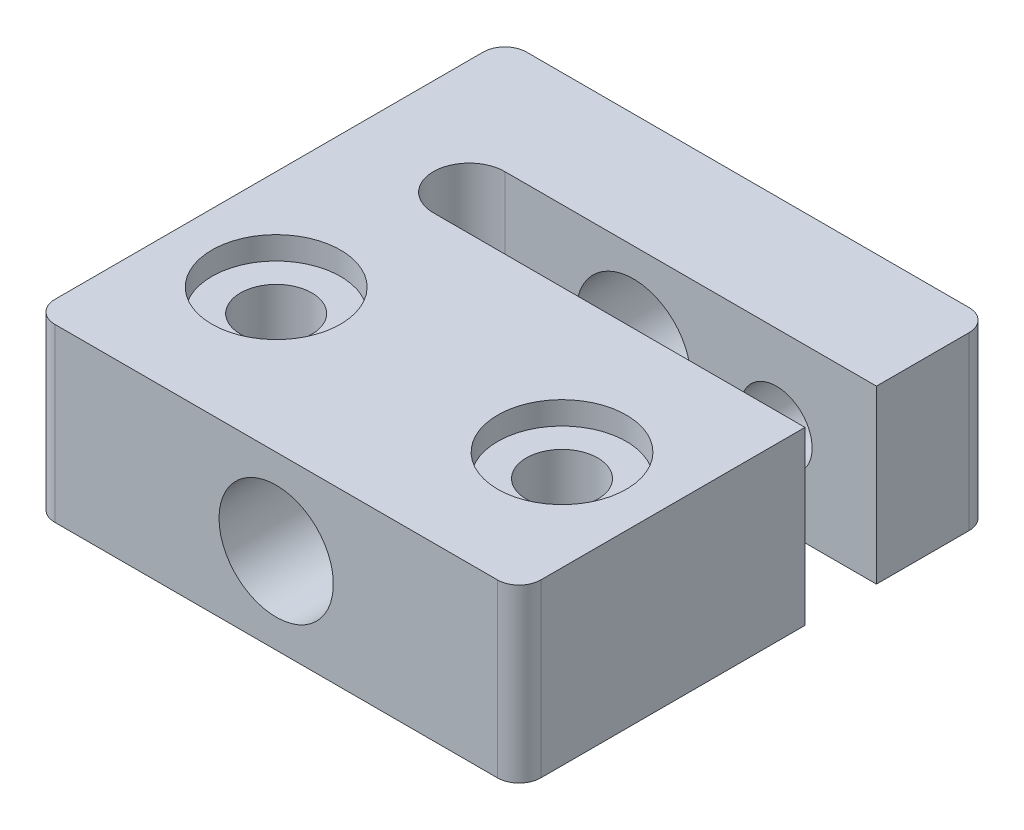
ISO-10303-21;
HEADER;
FILE_DESCRIPTION(('STEP AP214'),'2;1');
FILE_NAME('part.step','',(''),(''),'','','');
FILE_SCHEMA(('AUTOMOTIVE_DESIGN { 1 0 10303 214 1 1 1 1 }'));
ENDSEC;
DATA;
#1=APPLICATION_CONTEXT('core data for automotive mechanical design processes');
#2=APPLICATION_PROTOCOL_DEFINITION('international standard','automotive_design',2000,#1);
#3=PRODUCT_CONTEXT('',#1,'mechanical');
#4=PRODUCT('Part','Part','',(#3));
#5=PRODUCT_RELATED_PRODUCT_CATEGORY('part','',(#4));
#6=PRODUCT_DEFINITION_FORMATION('','',#4);
#7=PRODUCT_DEFINITION_CONTEXT('part definition',#1,'design');
#8=PRODUCT_DEFINITION('design','',#6,#7);
#9=PRODUCT_DEFINITION_SHAPE('','',#8);
#10=(LENGTH_UNIT() NAMED_UNIT(*) SI_UNIT(.MILLI.,.METRE.));
#11=(NAMED_UNIT(*) PLANE_ANGLE_UNIT() SI_UNIT($,.RADIAN.));
#12=(NAMED_UNIT(*) SI_UNIT($,.STERADIAN.) SOLID_ANGLE_UNIT());
#13=UNCERTAINTY_MEASURE_WITH_UNIT(LENGTH_MEASURE(1.E-05),#10,'distance_accuracy_value','');
#14=(GEOMETRIC_REPRESENTATION_CONTEXT(3) GLOBAL_UNCERTAINTY_ASSIGNED_CONTEXT((#13)) GLOBAL_UNIT_ASSIGNED_CONTEXT((#10,
#11,#12)) REPRESENTATION_CONTEXT('',''));
#15=CARTESIAN_POINT('',(0.,0.,0.));
#16=DIRECTION('',(0.,0.,1.));
#17=DIRECTION('',(1.,0.,0.));
#18=AXIS2_PLACEMENT_3D('',#15,#16,#17);
#19=CARTESIAN_POINT('',(-10.,12.,-10.));
#20=DIRECTION('',(0.,-1.,0.));
#21=DIRECTION('',(0.,0.,-1.));
#22=AXIS2_PLACEMENT_3D('',#19,#20,#21);
#23=CYLINDRICAL_SURFACE('',#22,2.5);
#24=CARTESIAN_POINT('',(-10.,10.4,-10.));
#25=DIRECTION('',(0.,1.,0.));
#26=DIRECTION('',(0.,0.,1.));
#27=AXIS2_PLACEMENT_3D('',#24,#25,#26);
#28=CIRCLE('',#27,2.5);
#29=CARTESIAN_POINT('',(-10.,10.4,-7.5));
#30=VERTEX_POINT('',#29);
#31=EDGE_CURVE('E310',#30,#30,#28,.T.);
#32=ORIENTED_EDGE('',*,*,#31,.T.);
#33=EDGE_LOOP('',(#32));
#34=FACE_BOUND('',#33,.T.);
#35=CARTESIAN_POINT('',(-10.,4.97,-10.));
#36=DIRECTION('',(0.,-1.,0.));
#37=DIRECTION('',(0.,0.,-1.));
#38=AXIS2_PLACEMENT_3D('',#35,#36,#37);
#39=CIRCLE('',#38,2.5);
#40=CARTESIAN_POINT('',(-10.,4.97,-12.5));
#41=VERTEX_POINT('',#40);
#42=EDGE_CURVE('E37',#41,#41,#39,.T.);
#43=ORIENTED_EDGE('',*,*,#42,.T.);
#44=EDGE_LOOP('',(#43));
#45=FACE_BOUND('',#44,.T.);
#46=ADVANCED_FACE('F33',(#34,#45),#23,.F.);
#47=CARTESIAN_POINT('',(10.,12.,-10.));
#48=DIRECTION('',(0.,-1.,0.));
#49=DIRECTION('',(0.,0.,-1.));
#50=AXIS2_PLACEMENT_3D('',#47,#48,#49);
#51=CYLINDRICAL_SURFACE('',#50,2.5);
#52=CARTESIAN_POINT('',(10.,10.4,-10.));
#53=DIRECTION('',(0.,1.,0.));
#54=DIRECTION('',(0.,0.,1.));
#55=AXIS2_PLACEMENT_3D('',#52,#53,#54);
#56=CIRCLE('',#55,2.5);
#57=CARTESIAN_POINT('',(10.,10.4,-7.50000000000001));
#58=VERTEX_POINT('',#57);
#59=EDGE_CURVE('E303',#58,#58,#56,.T.);
#60=ORIENTED_EDGE('',*,*,#59,.T.);
#61=EDGE_LOOP('',(#60));
#62=FACE_BOUND('',#61,.T.);
#63=CARTESIAN_POINT('',(10.,4.97,-10.));
#64=DIRECTION('',(0.,-1.,0.));
#65=DIRECTION('',(0.,0.,-1.));
#66=AXIS2_PLACEMENT_3D('',#63,#64,#65);
#67=CIRCLE('',#66,2.5);
#68=CARTESIAN_POINT('',(10.,4.97,-12.5));
#69=VERTEX_POINT('',#68);
#70=EDGE_CURVE('E290',#69,#69,#67,.T.);
#71=ORIENTED_EDGE('',*,*,#70,.T.);
#72=EDGE_LOOP('',(#71));
#73=FACE_BOUND('',#72,.T.);
#74=ADVANCED_FACE('F402',(#62,#73),#51,.F.);
#75=CARTESIAN_POINT('',(-15.48,12.,-1.52));
#76=DIRECTION('',(0.,1.,0.));
#77=DIRECTION('',(0.,0.,1.));
#78=AXIS2_PLACEMENT_3D('',#75,#76,#77);
#79=PLANE('',#78);
#80=CARTESIAN_POINT('',(10.,12.,-10.));
#81=DIRECTION('',(0.,1.,0.));
#82=DIRECTION('',(0.,0.,1.));
#83=AXIS2_PLACEMENT_3D('',#80,#81,#82);
#84=CIRCLE('',#83,4.5);
#85=CARTESIAN_POINT('',(10.,12.,-5.5));
#86=VERTEX_POINT('',#85);
#87=EDGE_CURVE('E304',#86,#86,#84,.T.);
#88=ORIENTED_EDGE('',*,*,#87,.F.);
#89=EDGE_LOOP('',(#88));
#90=FACE_BOUND('',#89,.T.);
#91=CARTESIAN_POINT('',(-10.,12.,-10.));
#92=DIRECTION('',(0.,1.,0.));
#93=DIRECTION('',(0.,0.,1.));
#94=AXIS2_PLACEMENT_3D('',#91,#92,#93);
#95=CIRCLE('',#94,4.5);
#96=CARTESIAN_POINT('',(-10.,12.,-5.5));
#97=VERTEX_POINT('',#96);
#98=EDGE_CURVE('E311',#97,#97,#95,.T.);
#99=ORIENTED_EDGE('',*,*,#98,.F.);
#100=EDGE_LOOP('',(#99));
#101=FACE_BOUND('',#100,.T.);
#102=CARTESIAN_POINT('',(-15.48,12.,-1.52));
#103=DIRECTION('',(0.,1.,0.));
#104=DIRECTION('',(0.,0.,1.));
#105=AXIS2_PLACEMENT_3D('',#102,#103,#104);
#106=CIRCLE('',#105,1.52);
#107=CARTESIAN_POINT('',(-17.,12.,-1.52));
#108=VERTEX_POINT('',#107);
#109=CARTESIAN_POINT('',(-15.48,12.,0.));
#110=VERTEX_POINT('',#109);
#111=EDGE_CURVE('E314',#108,#110,#106,.T.);
#112=ORIENTED_EDGE('',*,*,#111,.T.);
#113=DIRECTION('',(1.,0.,0.));
#114=VECTOR('',#113,1.);
#115=CARTESIAN_POINT('',(-15.48,12.,0.));
#116=LINE('',#115,#114);
#117=CARTESIAN_POINT('',(15.48,12.,0.));
#118=VERTEX_POINT('',#117);
#119=EDGE_CURVE('E317',#110,#118,#116,.T.);
#120=ORIENTED_EDGE('',*,*,#119,.T.);
#121=CARTESIAN_POINT('',(15.48,12.,-1.52));
#122=DIRECTION('',(0.,1.,0.));
#123=DIRECTION('',(0.,0.,1.));
#124=AXIS2_PLACEMENT_3D('',#121,#122,#123);
#125=CIRCLE('',#124,1.52);
#126=CARTESIAN_POINT('',(17.,12.,-1.52));
#127=VERTEX_POINT('',#126);
#128=EDGE_CURVE('E320',#118,#127,#125,.T.);
#129=ORIENTED_EDGE('',*,*,#128,.T.);
#130=DIRECTION('',(0.,0.,-1.));
#131=VECTOR('',#130,1.);
#132=CARTESIAN_POINT('',(17.,12.,-1.52));
#133=LINE('',#132,#131);
#134=CARTESIAN_POINT('',(17.,12.,-20.));
#135=VERTEX_POINT('',#134);
#136=EDGE_CURVE('E322',#127,#135,#133,.T.);
#137=ORIENTED_EDGE('',*,*,#136,.T.);
#138=DIRECTION('',(-1.,0.,0.));
#139=VECTOR('',#138,1.);
#140=CARTESIAN_POINT('',(-9.,12.,-20.));
#141=LINE('',#140,#139);
#142=CARTESIAN_POINT('',(-9.,12.,-20.));
#143=VERTEX_POINT('',#142);
#144=EDGE_CURVE('E324',#135,#143,#141,.T.);
#145=ORIENTED_EDGE('',*,*,#144,.T.);
#146=CARTESIAN_POINT('',(-9.,12.,-22.5));
#147=DIRECTION('',(0.,-1.,0.));
#148=DIRECTION('',(0.,0.,1.));
#149=AXIS2_PLACEMENT_3D('',#146,#147,#148);
#150=CIRCLE('',#149,2.5);
#151=CARTESIAN_POINT('',(-9.,12.,-25.));
#152=VERTEX_POINT('',#151);
#153=EDGE_CURVE('E326',#143,#152,#150,.T.);
#154=ORIENTED_EDGE('',*,*,#153,.T.);
#155=DIRECTION('',(1.,0.,0.));
#156=VECTOR('',#155,1.);
#157=CARTESIAN_POINT('',(17.,12.,-25.));
#158=LINE('',#157,#156);
#159=CARTESIAN_POINT('',(17.,12.,-25.));
#160=VERTEX_POINT('',#159);
#161=EDGE_CURVE('E328',#152,#160,#158,.T.);
#162=ORIENTED_EDGE('',*,*,#161,.T.);
#163=DIRECTION('',(0.,0.,-1.));
#164=VECTOR('',#163,1.);
#165=CARTESIAN_POINT('',(17.,12.,-31.48));
#166=LINE('',#165,#164);
#167=CARTESIAN_POINT('',(17.,12.,-31.48));
#168=VERTEX_POINT('',#167);
#169=EDGE_CURVE('E330',#160,#168,#166,.T.);
#170=ORIENTED_EDGE('',*,*,#169,.T.);
#171=CARTESIAN_POINT('',(15.48,12.,-31.48));
#172=DIRECTION('',(0.,1.,0.));
#173=DIRECTION('',(0.,0.,1.));
#174=AXIS2_PLACEMENT_3D('',#171,#172,#173);
#175=CIRCLE('',#174,1.52);
#176=CARTESIAN_POINT('',(15.48,12.,-33.));
#177=VERTEX_POINT('',#176);
#178=EDGE_CURVE('E332',#168,#177,#175,.T.);
#179=ORIENTED_EDGE('',*,*,#178,.T.);
#180=DIRECTION('',(-1.,0.,0.));
#181=VECTOR('',#180,1.);
#182=CARTESIAN_POINT('',(-15.48,12.,-33.));
#183=LINE('',#182,#181);
#184=CARTESIAN_POINT('',(-15.48,12.,-33.));
#185=VERTEX_POINT('',#184);
#186=EDGE_CURVE('E334',#177,#185,#183,.T.);
#187=ORIENTED_EDGE('',*,*,#186,.T.);
#188=CARTESIAN_POINT('',(-15.48,12.,-31.48));
#189=DIRECTION('',(0.,1.,0.));
#190=DIRECTION('',(0.,0.,1.));
#191=AXIS2_PLACEMENT_3D('',#188,#189,#190);
#192=CIRCLE('',#191,1.52);
#193=CARTESIAN_POINT('',(-17.,12.,-31.48));
#194=VERTEX_POINT('',#193);
#195=EDGE_CURVE('E336',#185,#194,#192,.T.);
#196=ORIENTED_EDGE('',*,*,#195,.T.);
#197=DIRECTION('',(0.,0.,1.));
#198=VECTOR('',#197,1.);
#199=CARTESIAN_POINT('',(-17.,12.,-1.52));
#200=LINE('',#199,#198);
#201=EDGE_CURVE('E338',#194,#108,#200,.T.);
#202=ORIENTED_EDGE('',*,*,#201,.T.);
#203=EDGE_LOOP('',(#112,#120,#129,#137,#145,#154,#162,#170,#179,#187,#196,#202));
#204=FACE_BOUND('',#203,.T.);
#205=ADVANCED_FACE('F434',(#90,#101,#204),#79,.T.);
#206=CARTESIAN_POINT('',(-15.48,0.,-1.52));
#207=DIRECTION('',(0.,1.,0.));
#208=DIRECTION('',(0.,0.,1.));
#209=AXIS2_PLACEMENT_3D('',#206,#207,#208);
#210=PLANE('',#209);
#211=DIRECTION('',(0.866025403784439,0.,-0.499999999999999));
#212=VECTOR('',#211,1.);
#213=CARTESIAN_POINT('',(-14.,0.,-12.3094010767585));
#214=LINE('',#213,#212);
#215=CARTESIAN_POINT('',(-14.,0.,-12.3094010767585));
#216=VERTEX_POINT('',#215);
#217=CARTESIAN_POINT('',(-9.99999999999999,0.,-14.618802153517));
#218=VERTEX_POINT('',#217);
#219=EDGE_CURVE('E234',#216,#218,#214,.T.);
#220=ORIENTED_EDGE('',*,*,#219,.F.);
#221=DIRECTION('',(0.,0.,-1.));
#222=VECTOR('',#221,1.);
#223=CARTESIAN_POINT('',(-14.,0.,-7.6905989232415));
#224=LINE('',#223,#222);
#225=CARTESIAN_POINT('',(-14.,0.,-7.6905989232415));
#226=VERTEX_POINT('',#225);
#227=EDGE_CURVE('E50',#226,#216,#224,.T.);
#228=ORIENTED_EDGE('',*,*,#227,.F.);
#229=DIRECTION('',(-0.866025403784439,0.,-0.5));
#230=VECTOR('',#229,1.);
#231=CARTESIAN_POINT('',(-10.,0.,-5.381197846483));
#232=LINE('',#231,#230);
#233=CARTESIAN_POINT('',(-10.,0.,-5.381197846483));
#234=VERTEX_POINT('',#233);
#235=EDGE_CURVE('E217',#234,#226,#232,.T.);
#236=ORIENTED_EDGE('',*,*,#235,.F.);
#237=DIRECTION('',(-0.866025403784439,0.,0.5));
#238=VECTOR('',#237,1.);
#239=CARTESIAN_POINT('',(-6.,0.,-7.6905989232415));
#240=LINE('',#239,#238);
#241=CARTESIAN_POINT('',(-6.,0.,-7.6905989232415));
#242=VERTEX_POINT('',#241);
#243=EDGE_CURVE('E220',#242,#234,#240,.T.);
#244=ORIENTED_EDGE('',*,*,#243,.F.);
#245=DIRECTION('',(0.,0.,1.));
#246=VECTOR('',#245,1.);
#247=CARTESIAN_POINT('',(-6.,0.,-12.3094010767585));
#248=LINE('',#247,#246);
#249=CARTESIAN_POINT('',(-6.,0.,-12.3094010767585));
#250=VERTEX_POINT('',#249);
#251=EDGE_CURVE('E239',#250,#242,#248,.T.);
#252=ORIENTED_EDGE('',*,*,#251,.F.);
#253=DIRECTION('',(0.866025403784439,0.,0.5));
#254=VECTOR('',#253,1.);
#255=CARTESIAN_POINT('',(-9.99999999999999,0.,-14.618802153517));
#256=LINE('',#255,#254);
#257=EDGE_CURVE('E236',#218,#250,#256,.T.);
#258=ORIENTED_EDGE('',*,*,#257,.F.);
#259=EDGE_LOOP('',(#220,#228,#236,#244,#252,#258));
#260=FACE_BOUND('',#259,.T.);
#261=DIRECTION('',(0.,0.,-1.));
#262=VECTOR('',#261,1.);
#263=CARTESIAN_POINT('',(6.00000000000001,0.,-7.6905989232415));
#264=LINE('',#263,#262);
#265=CARTESIAN_POINT('',(6.00000000000001,0.,-7.6905989232415));
#266=VERTEX_POINT('',#265);
#267=CARTESIAN_POINT('',(6.00000000000001,0.,-12.3094010767585));
#268=VERTEX_POINT('',#267);
#269=EDGE_CURVE('E274',#266,#268,#264,.T.);
#270=ORIENTED_EDGE('',*,*,#269,.F.);
#271=DIRECTION('',(-0.866025403784439,0.,-0.5));
#272=VECTOR('',#271,1.);
#273=CARTESIAN_POINT('',(10.,0.,-5.381197846483));
#274=LINE('',#273,#272);
#275=CARTESIAN_POINT('',(10.,0.,-5.381197846483));
#276=VERTEX_POINT('',#275);
#277=EDGE_CURVE('E58',#276,#266,#274,.T.);
#278=ORIENTED_EDGE('',*,*,#277,.F.);
#279=DIRECTION('',(-0.866025403784439,0.,0.5));
#280=VECTOR('',#279,1.);
#281=CARTESIAN_POINT('',(14.,0.,-7.6905989232415));
#282=LINE('',#281,#280);
#283=CARTESIAN_POINT('',(14.,0.,-7.6905989232415));
#284=VERTEX_POINT('',#283);
#285=EDGE_CURVE('E257',#284,#276,#282,.T.);
#286=ORIENTED_EDGE('',*,*,#285,.F.);
#287=DIRECTION('',(0.,0.,1.));
#288=VECTOR('',#287,1.);
#289=CARTESIAN_POINT('',(14.,0.,-12.3094010767585));
#290=LINE('',#289,#288);
#291=CARTESIAN_POINT('',(14.,0.,-12.3094010767585));
#292=VERTEX_POINT('',#291);
#293=EDGE_CURVE('E283',#292,#284,#290,.T.);
#294=ORIENTED_EDGE('',*,*,#293,.F.);
#295=DIRECTION('',(0.866025403784439,0.,0.5));
#296=VECTOR('',#295,1.);
#297=CARTESIAN_POINT('',(10.,0.,-14.618802153517));
#298=LINE('',#297,#296);
#299=CARTESIAN_POINT('',(10.,0.,-14.618802153517));
#300=VERTEX_POINT('',#299);
#301=EDGE_CURVE('E280',#300,#292,#298,.T.);
#302=ORIENTED_EDGE('',*,*,#301,.F.);
#303=DIRECTION('',(0.866025403784439,0.,-0.5));
#304=VECTOR('',#303,1.);
#305=CARTESIAN_POINT('',(6.00000000000001,0.,-12.3094010767585));
#306=LINE('',#305,#304);
#307=EDGE_CURVE('E277',#268,#300,#306,.T.);
#308=ORIENTED_EDGE('',*,*,#307,.F.);
#309=EDGE_LOOP('',(#270,#278,#286,#294,#302,#308));
#310=FACE_BOUND('',#309,.T.);
#311=CARTESIAN_POINT('',(-15.48,0.,-1.52));
#312=DIRECTION('',(0.,1.,0.));
#313=DIRECTION('',(0.,0.,1.));
#314=AXIS2_PLACEMENT_3D('',#311,#312,#313);
#315=CIRCLE('',#314,1.52);
#316=CARTESIAN_POINT('',(-17.,0.,-1.52));
#317=VERTEX_POINT('',#316);
#318=CARTESIAN_POINT('',(-15.48,0.,0.));
#319=VERTEX_POINT('',#318);
#320=EDGE_CURVE('E341',#317,#319,#315,.T.);
#321=ORIENTED_EDGE('',*,*,#320,.F.);
#322=DIRECTION('',(0.,0.,1.));
#323=VECTOR('',#322,1.);
#324=CARTESIAN_POINT('',(-17.,0.,-1.52));
#325=LINE('',#324,#323);
#326=CARTESIAN_POINT('',(-17.,0.,-31.48));
#327=VERTEX_POINT('',#326);
#328=EDGE_CURVE('E318',#327,#317,#325,.T.);
#329=ORIENTED_EDGE('',*,*,#328,.F.);
#330=CARTESIAN_POINT('',(-15.48,0.,-31.48));
#331=DIRECTION('',(0.,1.,0.));
#332=DIRECTION('',(0.,0.,1.));
#333=AXIS2_PLACEMENT_3D('',#330,#331,#332);
#334=CIRCLE('',#333,1.52);
#335=CARTESIAN_POINT('',(-15.48,0.,-33.));
#336=VERTEX_POINT('',#335);
#337=EDGE_CURVE('E362',#336,#327,#334,.T.);
#338=ORIENTED_EDGE('',*,*,#337,.F.);
#339=DIRECTION('',(-1.,0.,0.));
#340=VECTOR('',#339,1.);
#341=CARTESIAN_POINT('',(-15.48,0.,-33.));
#342=LINE('',#341,#340);
#343=CARTESIAN_POINT('',(15.48,0.,-33.));
#344=VERTEX_POINT('',#343);
#345=EDGE_CURVE('E360',#344,#336,#342,.T.);
#346=ORIENTED_EDGE('',*,*,#345,.F.);
#347=CARTESIAN_POINT('',(15.48,0.,-31.48));
#348=DIRECTION('',(0.,1.,0.));
#349=DIRECTION('',(0.,0.,1.));
#350=AXIS2_PLACEMENT_3D('',#347,#348,#349);
#351=CIRCLE('',#350,1.52);
#352=CARTESIAN_POINT('',(17.,0.,-31.48));
#353=VERTEX_POINT('',#352);
#354=EDGE_CURVE('E358',#353,#344,#351,.T.);
#355=ORIENTED_EDGE('',*,*,#354,.F.);
#356=DIRECTION('',(0.,0.,-1.));
#357=VECTOR('',#356,1.);
#358=CARTESIAN_POINT('',(17.,0.,-31.48));
#359=LINE('',#358,#357);
#360=CARTESIAN_POINT('',(17.,0.,-25.));
#361=VERTEX_POINT('',#360);
#362=EDGE_CURVE('E356',#361,#353,#359,.T.);
#363=ORIENTED_EDGE('',*,*,#362,.F.);
#364=DIRECTION('',(1.,0.,0.));
#365=VECTOR('',#364,1.);
#366=CARTESIAN_POINT('',(17.,0.,-25.));
#367=LINE('',#366,#365);
#368=CARTESIAN_POINT('',(-9.,0.,-25.));
#369=VERTEX_POINT('',#368);
#370=EDGE_CURVE('E354',#369,#361,#367,.T.);
#371=ORIENTED_EDGE('',*,*,#370,.F.);
#372=CARTESIAN_POINT('',(-9.,0.,-22.5));
#373=DIRECTION('',(0.,-1.,0.));
#374=DIRECTION('',(0.,0.,1.));
#375=AXIS2_PLACEMENT_3D('',#372,#373,#374);
#376=CIRCLE('',#375,2.5);
#377=CARTESIAN_POINT('',(-9.,0.,-20.));
#378=VERTEX_POINT('',#377);
#379=EDGE_CURVE('E352',#378,#369,#376,.T.);
#380=ORIENTED_EDGE('',*,*,#379,.F.);
#381=DIRECTION('',(-1.,0.,0.));
#382=VECTOR('',#381,1.);
#383=CARTESIAN_POINT('',(-9.,0.,-20.));
#384=LINE('',#383,#382);
#385=CARTESIAN_POINT('',(17.,0.,-20.));
#386=VERTEX_POINT('',#385);
#387=EDGE_CURVE('E350',#386,#378,#384,.T.);
#388=ORIENTED_EDGE('',*,*,#387,.F.);
#389=DIRECTION('',(0.,0.,-1.));
#390=VECTOR('',#389,1.);
#391=CARTESIAN_POINT('',(17.,0.,-1.52));
#392=LINE('',#391,#390);
#393=CARTESIAN_POINT('',(17.,0.,-1.52));
#394=VERTEX_POINT('',#393);
#395=EDGE_CURVE('E348',#394,#386,#392,.T.);
#396=ORIENTED_EDGE('',*,*,#395,.F.);
#397=CARTESIAN_POINT('',(15.48,0.,-1.52));
#398=DIRECTION('',(0.,1.,0.));
#399=DIRECTION('',(0.,0.,1.));
#400=AXIS2_PLACEMENT_3D('',#397,#398,#399);
#401=CIRCLE('',#400,1.52);
#402=CARTESIAN_POINT('',(15.48,0.,0.));
#403=VERTEX_POINT('',#402);
#404=EDGE_CURVE('E346',#403,#394,#401,.T.);
#405=ORIENTED_EDGE('',*,*,#404,.F.);
#406=DIRECTION('',(1.,0.,0.));
#407=VECTOR('',#406,1.);
#408=CARTESIAN_POINT('',(-15.48,0.,0.));
#409=LINE('',#408,#407);
#410=EDGE_CURVE('E344',#319,#403,#409,.T.);
#411=ORIENTED_EDGE('',*,*,#410,.F.);
#412=EDGE_LOOP('',(#321,#329,#338,#346,#355,#363,#371,#380,#388,#396,#405,#411));
#413=FACE_BOUND('',#412,.T.);
#414=ADVANCED_FACE('F431',(#260,#310,#413),#210,.F.);
#415=CARTESIAN_POINT('',(-15.48,12.,-1.52));
#416=DIRECTION('',(0.,-1.,0.));
#417=DIRECTION('',(0.,0.,-1.));
#418=AXIS2_PLACEMENT_3D('',#415,#416,#417);
#419=CYLINDRICAL_SURFACE('',#418,1.52);
#420=ORIENTED_EDGE('',*,*,#320,.T.);
#421=DIRECTION('',(0.,-1.,0.));
#422=VECTOR('',#421,1.);
#423=CARTESIAN_POINT('',(-15.48,12.,0.));
#424=LINE('',#423,#422);
#425=EDGE_CURVE('E11',#110,#319,#424,.T.);
#426=ORIENTED_EDGE('',*,*,#425,.F.);
#427=ORIENTED_EDGE('',*,*,#111,.F.);
#428=DIRECTION('',(0.,-1.,0.));
#429=VECTOR('',#428,1.);
#430=CARTESIAN_POINT('',(-17.,12.,-1.52));
#431=LINE('',#430,#429);
#432=EDGE_CURVE('E340',#108,#317,#431,.T.);
#433=ORIENTED_EDGE('',*,*,#432,.T.);
#434=EDGE_LOOP('',(#420,#426,#427,#433));
#435=FACE_BOUND('',#434,.T.);
#436=ADVANCED_FACE('F35',(#435),#419,.T.);
#437=CARTESIAN_POINT('',(-15.48,12.,0.));
#438=DIRECTION('',(0.,0.,-1.));
#439=DIRECTION('',(-1.,0.,0.));
#440=AXIS2_PLACEMENT_3D('',#437,#438,#439);
#441=PLANE('',#440);
#442=CARTESIAN_POINT('',(0.,6.,0.));
#443=DIRECTION('',(0.,0.,-1.));
#444=DIRECTION('',(-1.,0.,0.));
#445=AXIS2_PLACEMENT_3D('',#442,#443,#444);
#446=CIRCLE('',#445,4.);
#447=CARTESIAN_POINT('',(-4.,6.,0.));
#448=VERTEX_POINT('',#447);
#449=EDGE_CURVE('E587',#448,#448,#446,.T.);
#450=ORIENTED_EDGE('',*,*,#449,.T.);
#451=EDGE_LOOP('',(#450));
#452=FACE_BOUND('',#451,.T.);
#453=ORIENTED_EDGE('',*,*,#410,.T.);
#454=DIRECTION('',(0.,-1.,0.));
#455=VECTOR('',#454,1.);
#456=CARTESIAN_POINT('',(15.48,12.,0.));
#457=LINE('',#456,#455);
#458=EDGE_CURVE('E42',#118,#403,#457,.T.);
#459=ORIENTED_EDGE('',*,*,#458,.F.);
#460=ORIENTED_EDGE('',*,*,#119,.F.);
#461=ORIENTED_EDGE('',*,*,#425,.T.);
#462=EDGE_LOOP('',(#453,#459,#460,#461));
#463=FACE_BOUND('',#462,.T.);
#464=ADVANCED_FACE('F493',(#452,#463),#441,.F.);
#465=CARTESIAN_POINT('',(15.48,12.,-1.52));
#466=DIRECTION('',(0.,-1.,0.));
#467=DIRECTION('',(0.,0.,-1.));
#468=AXIS2_PLACEMENT_3D('',#465,#466,#467);
#469=CYLINDRICAL_SURFACE('',#468,1.52);
#470=ORIENTED_EDGE('',*,*,#404,.T.);
#471=DIRECTION('',(0.,-1.,0.));
#472=VECTOR('',#471,1.);
#473=CARTESIAN_POINT('',(17.,12.,-1.52));
#474=LINE('',#473,#472);
#475=EDGE_CURVE('E391',#127,#394,#474,.T.);
#476=ORIENTED_EDGE('',*,*,#475,.F.);
#477=ORIENTED_EDGE('',*,*,#128,.F.);
#478=ORIENTED_EDGE('',*,*,#458,.T.);
#479=EDGE_LOOP('',(#470,#476,#477,#478));
#480=FACE_BOUND('',#479,.T.);
#481=ADVANCED_FACE('F490',(#480),#469,.T.);
#482=CARTESIAN_POINT('',(17.,12.,-1.52));
#483=DIRECTION('',(-1.,0.,0.));
#484=DIRECTION('',(0.,0.,1.));
#485=AXIS2_PLACEMENT_3D('',#482,#483,#484);
#486=PLANE('',#485);
#487=ORIENTED_EDGE('',*,*,#395,.T.);
#488=DIRECTION('',(0.,-1.,0.));
#489=VECTOR('',#488,1.);
#490=CARTESIAN_POINT('',(17.,12.,-20.));
#491=LINE('',#490,#489);
#492=EDGE_CURVE('E388',#135,#386,#491,.T.);
#493=ORIENTED_EDGE('',*,*,#492,.F.);
#494=ORIENTED_EDGE('',*,*,#136,.F.);
#495=ORIENTED_EDGE('',*,*,#475,.T.);
#496=EDGE_LOOP('',(#487,#493,#494,#495));
#497=FACE_BOUND('',#496,.T.);
#498=ADVANCED_FACE('F485',(#497),#486,.F.);
#499=CARTESIAN_POINT('',(-9.,12.,-20.));
#500=DIRECTION('',(0.,0.,1.));
#501=DIRECTION('',(1.,0.,0.));
#502=AXIS2_PLACEMENT_3D('',#499,#500,#501);
#503=PLANE('',#502);
#504=CARTESIAN_POINT('',(0.,6.,-20.));
#505=DIRECTION('',(0.,0.,1.));
#506=DIRECTION('',(1.,0.,0.));
#507=AXIS2_PLACEMENT_3D('',#504,#505,#506);
#508=CIRCLE('',#507,4.);
#509=CARTESIAN_POINT('',(4.,6.,-20.));
#510=VERTEX_POINT('',#509);
#511=EDGE_CURVE('E223',#510,#510,#508,.T.);
#512=ORIENTED_EDGE('',*,*,#511,.T.);
#513=EDGE_LOOP('',(#512));
#514=FACE_BOUND('',#513,.T.);
#515=ORIENTED_EDGE('',*,*,#387,.T.);
#516=DIRECTION('',(0.,-1.,0.));
#517=VECTOR('',#516,1.);
#518=CARTESIAN_POINT('',(-9.,12.,-20.));
#519=LINE('',#518,#517);
#520=EDGE_CURVE('E385',#143,#378,#519,.T.);
#521=ORIENTED_EDGE('',*,*,#520,.F.);
#522=ORIENTED_EDGE('',*,*,#144,.F.);
#523=ORIENTED_EDGE('',*,*,#492,.T.);
#524=EDGE_LOOP('',(#515,#521,#522,#523));
#525=FACE_BOUND('',#524,.T.);
#526=ADVANCED_FACE('F481',(#514,#525),#503,.F.);
#527=CARTESIAN_POINT('',(-9.,12.,-22.5));
#528=DIRECTION('',(0.,-1.,0.));
#529=DIRECTION('',(0.,0.,-1.));
#530=AXIS2_PLACEMENT_3D('',#527,#528,#529);
#531=CYLINDRICAL_SURFACE('',#530,2.5);
#532=ORIENTED_EDGE('',*,*,#379,.T.);
#533=DIRECTION('',(0.,-1.,0.));
#534=VECTOR('',#533,1.);
#535=CARTESIAN_POINT('',(-9.,12.,-25.));
#536=LINE('',#535,#534);
#537=EDGE_CURVE('E382',#152,#369,#536,.T.);
#538=ORIENTED_EDGE('',*,*,#537,.F.);
#539=ORIENTED_EDGE('',*,*,#153,.F.);
#540=ORIENTED_EDGE('',*,*,#520,.T.);
#541=EDGE_LOOP('',(#532,#538,#539,#540));
#542=FACE_BOUND('',#541,.T.);
#543=ADVANCED_FACE('F477',(#542),#531,.F.);
#544=CARTESIAN_POINT('',(17.,12.,-25.));
#545=DIRECTION('',(0.,0.,-1.));
#546=DIRECTION('',(-1.,0.,0.));
#547=AXIS2_PLACEMENT_3D('',#544,#545,#546);
#548=PLANE('',#547);
#549=CARTESIAN_POINT('',(10.,6.,-25.));
#550=DIRECTION('',(0.,0.,-1.));
#551=DIRECTION('',(-1.,0.,0.));
#552=AXIS2_PLACEMENT_3D('',#549,#550,#551);
#553=CIRCLE('',#552,2.5);
#554=CARTESIAN_POINT('',(7.5,6.,-25.));
#555=VERTEX_POINT('',#554);
#556=EDGE_CURVE('E582',#555,#555,#553,.F.);
#557=ORIENTED_EDGE('',*,*,#556,.F.);
#558=EDGE_LOOP('',(#557));
#559=FACE_BOUND('',#558,.T.);
#560=CARTESIAN_POINT('',(0.,6.,-25.));
#561=DIRECTION('',(0.,0.,-1.));
#562=DIRECTION('',(-1.,0.,0.));
#563=AXIS2_PLACEMENT_3D('',#560,#561,#562);
#564=CIRCLE('',#563,4.);
#565=CARTESIAN_POINT('',(-4.,6.,-25.));
#566=VERTEX_POINT('',#565);
#567=EDGE_CURVE('E592',#566,#566,#564,.T.);
#568=ORIENTED_EDGE('',*,*,#567,.T.);
#569=EDGE_LOOP('',(#568));
#570=FACE_BOUND('',#569,.T.);
#571=ORIENTED_EDGE('',*,*,#370,.T.);
#572=DIRECTION('',(0.,-1.,0.));
#573=VECTOR('',#572,1.);
#574=CARTESIAN_POINT('',(17.,12.,-25.));
#575=LINE('',#574,#573);
#576=EDGE_CURVE('E379',#160,#361,#575,.T.);
#577=ORIENTED_EDGE('',*,*,#576,.F.);
#578=ORIENTED_EDGE('',*,*,#161,.F.);
#579=ORIENTED_EDGE('',*,*,#537,.T.);
#580=EDGE_LOOP('',(#571,#577,#578,#579));
#581=FACE_BOUND('',#580,.T.);
#582=ADVANCED_FACE('F472',(#559,#570,#581),#548,.F.);
#583=CARTESIAN_POINT('',(17.,12.,-31.48));
#584=DIRECTION('',(-1.,0.,0.));
#585=DIRECTION('',(0.,0.,1.));
#586=AXIS2_PLACEMENT_3D('',#583,#584,#585);
#587=PLANE('',#586);
#588=ORIENTED_EDGE('',*,*,#362,.T.);
#589=DIRECTION('',(0.,-1.,0.));
#590=VECTOR('',#589,1.);
#591=CARTESIAN_POINT('',(17.,12.,-31.48));
#592=LINE('',#591,#590);
#593=EDGE_CURVE('E376',#168,#353,#592,.T.);
#594=ORIENTED_EDGE('',*,*,#593,.F.);
#595=ORIENTED_EDGE('',*,*,#169,.F.);
#596=ORIENTED_EDGE('',*,*,#576,.T.);
#597=EDGE_LOOP('',(#588,#594,#595,#596));
#598=FACE_BOUND('',#597,.T.);
#599=ADVANCED_FACE('F466',(#598),#587,.F.);
#600=CARTESIAN_POINT('',(15.48,12.,-31.48));
#601=DIRECTION('',(0.,-1.,0.));
#602=DIRECTION('',(0.,0.,-1.));
#603=AXIS2_PLACEMENT_3D('',#600,#601,#602);
#604=CYLINDRICAL_SURFACE('',#603,1.52);
#605=ORIENTED_EDGE('',*,*,#354,.T.);
#606=DIRECTION('',(0.,-1.,0.));
#607=VECTOR('',#606,1.);
#608=CARTESIAN_POINT('',(15.48,12.,-33.));
#609=LINE('',#608,#607);
#610=EDGE_CURVE('E373',#177,#344,#609,.T.);
#611=ORIENTED_EDGE('',*,*,#610,.F.);
#612=ORIENTED_EDGE('',*,*,#178,.F.);
#613=ORIENTED_EDGE('',*,*,#593,.T.);
#614=EDGE_LOOP('',(#605,#611,#612,#613));
#615=FACE_BOUND('',#614,.T.);
#616=ADVANCED_FACE('F462',(#615),#604,.T.);
#617=CARTESIAN_POINT('',(-15.48,12.,-33.));
#618=DIRECTION('',(0.,0.,1.));
#619=DIRECTION('',(1.,0.,0.));
#620=AXIS2_PLACEMENT_3D('',#617,#618,#619);
#621=PLANE('',#620);
#622=CARTESIAN_POINT('',(10.,6.,-33.));
#623=DIRECTION('',(0.,0.,-1.));
#624=DIRECTION('',(-1.,0.,0.));
#625=AXIS2_PLACEMENT_3D('',#622,#623,#624);
#626=CIRCLE('',#625,2.5);
#627=CARTESIAN_POINT('',(7.5,6.,-33.));
#628=VERTEX_POINT('',#627);
#629=EDGE_CURVE('E579',#628,#628,#626,.T.);
#630=ORIENTED_EDGE('',*,*,#629,.F.);
#631=EDGE_LOOP('',(#630));
#632=FACE_BOUND('',#631,.T.);
#633=CARTESIAN_POINT('',(0.,6.,-33.));
#634=DIRECTION('',(0.,0.,-1.));
#635=DIRECTION('',(-1.,0.,0.));
#636=AXIS2_PLACEMENT_3D('',#633,#634,#635);
#637=CIRCLE('',#636,4.);
#638=CARTESIAN_POINT('',(-4.,6.,-33.));
#639=VERTEX_POINT('',#638);
#640=EDGE_CURVE('E584',#639,#639,#637,.T.);
#641=ORIENTED_EDGE('',*,*,#640,.F.);
#642=EDGE_LOOP('',(#641));
#643=FACE_BOUND('',#642,.T.);
#644=ORIENTED_EDGE('',*,*,#345,.T.);
#645=DIRECTION('',(0.,-1.,0.));
#646=VECTOR('',#645,1.);
#647=CARTESIAN_POINT('',(-15.48,12.,-33.));
#648=LINE('',#647,#646);
#649=EDGE_CURVE('E370',#185,#336,#648,.T.);
#650=ORIENTED_EDGE('',*,*,#649,.F.);
#651=ORIENTED_EDGE('',*,*,#186,.F.);
#652=ORIENTED_EDGE('',*,*,#610,.T.);
#653=EDGE_LOOP('',(#644,#650,#651,#652));
#654=FACE_BOUND('',#653,.T.);
#655=ADVANCED_FACE('F457',(#632,#643,#654),#621,.F.);
#656=CARTESIAN_POINT('',(-15.48,12.,-31.48));
#657=DIRECTION('',(0.,-1.,0.));
#658=DIRECTION('',(0.,0.,-1.));
#659=AXIS2_PLACEMENT_3D('',#656,#657,#658);
#660=CYLINDRICAL_SURFACE('',#659,1.52);
#661=ORIENTED_EDGE('',*,*,#337,.T.);
#662=DIRECTION('',(0.,-1.,0.));
#663=VECTOR('',#662,1.);
#664=CARTESIAN_POINT('',(-17.,12.,-31.48));
#665=LINE('',#664,#663);
#666=EDGE_CURVE('E367',#194,#327,#665,.T.);
#667=ORIENTED_EDGE('',*,*,#666,.F.);
#668=ORIENTED_EDGE('',*,*,#195,.F.);
#669=ORIENTED_EDGE('',*,*,#649,.T.);
#670=EDGE_LOOP('',(#661,#667,#668,#669));
#671=FACE_BOUND('',#670,.T.);
#672=ADVANCED_FACE('F451',(#671),#660,.T.);
#673=CARTESIAN_POINT('',(-17.,12.,-1.52));
#674=DIRECTION('',(1.,0.,0.));
#675=DIRECTION('',(0.,0.,-1.));
#676=AXIS2_PLACEMENT_3D('',#673,#674,#675);
#677=PLANE('',#676);
#678=ORIENTED_EDGE('',*,*,#328,.T.);
#679=ORIENTED_EDGE('',*,*,#432,.F.);
#680=ORIENTED_EDGE('',*,*,#201,.F.);
#681=ORIENTED_EDGE('',*,*,#666,.T.);
#682=EDGE_LOOP('',(#678,#679,#680,#681));
#683=FACE_BOUND('',#682,.T.);
#684=ADVANCED_FACE('F447',(#683),#677,.F.);
#685=CARTESIAN_POINT('',(-10.,10.4,-10.));
#686=DIRECTION('',(0.,1.,0.));
#687=DIRECTION('',(0.,0.,1.));
#688=AXIS2_PLACEMENT_3D('',#685,#686,#687);
#689=CYLINDRICAL_SURFACE('',#688,4.5);
#690=CARTESIAN_POINT('',(-10.,10.4,-10.));
#691=DIRECTION('',(0.,1.,0.));
#692=DIRECTION('',(0.,0.,1.));
#693=AXIS2_PLACEMENT_3D('',#690,#691,#692);
#694=CIRCLE('',#693,4.5);
#695=CARTESIAN_POINT('',(-10.,10.4,-5.5));
#696=VERTEX_POINT('',#695);
#697=EDGE_CURVE('E307',#696,#696,#694,.T.);
#698=ORIENTED_EDGE('',*,*,#697,.F.);
#699=EDGE_LOOP('',(#698));
#700=FACE_BOUND('',#699,.T.);
#701=ORIENTED_EDGE('',*,*,#98,.T.);
#702=EDGE_LOOP('',(#701));
#703=FACE_BOUND('',#702,.T.);
#704=ADVANCED_FACE('F515',(#700,#703),#689,.F.);
#705=CARTESIAN_POINT('',(-10.,10.4,-10.));
#706=DIRECTION('',(0.,1.,0.));
#707=DIRECTION('',(0.,0.,1.));
#708=AXIS2_PLACEMENT_3D('',#705,#706,#707);
#709=PLANE('',#708);
#710=ORIENTED_EDGE('',*,*,#31,.F.);
#711=EDGE_LOOP('',(#710));
#712=FACE_BOUND('',#711,.T.);
#713=ORIENTED_EDGE('',*,*,#697,.T.);
#714=EDGE_LOOP('',(#713));
#715=FACE_BOUND('',#714,.T.);
#716=ADVANCED_FACE('F518',(#712,#715),#709,.T.);
#717=CARTESIAN_POINT('',(10.,10.4,-10.));
#718=DIRECTION('',(0.,1.,0.));
#719=DIRECTION('',(0.,0.,1.));
#720=AXIS2_PLACEMENT_3D('',#717,#718,#719);
#721=CYLINDRICAL_SURFACE('',#720,4.5);
#722=CARTESIAN_POINT('',(10.,10.4,-10.));
#723=DIRECTION('',(0.,1.,0.));
#724=DIRECTION('',(0.,0.,1.));
#725=AXIS2_PLACEMENT_3D('',#722,#723,#724);
#726=CIRCLE('',#725,4.5);
#727=CARTESIAN_POINT('',(10.,10.4,-5.5));
#728=VERTEX_POINT('',#727);
#729=EDGE_CURVE('E300',#728,#728,#726,.T.);
#730=ORIENTED_EDGE('',*,*,#729,.F.);
#731=EDGE_LOOP('',(#730));
#732=FACE_BOUND('',#731,.T.);
#733=ORIENTED_EDGE('',*,*,#87,.T.);
#734=EDGE_LOOP('',(#733));
#735=FACE_BOUND('',#734,.T.);
#736=ADVANCED_FACE('F522',(#732,#735),#721,.F.);
#737=CARTESIAN_POINT('',(10.,10.4,-10.));
#738=DIRECTION('',(0.,1.,0.));
#739=DIRECTION('',(0.,0.,1.));
#740=AXIS2_PLACEMENT_3D('',#737,#738,#739);
#741=PLANE('',#740);
#742=ORIENTED_EDGE('',*,*,#59,.F.);
#743=EDGE_LOOP('',(#742));
#744=FACE_BOUND('',#743,.T.);
#745=ORIENTED_EDGE('',*,*,#729,.T.);
#746=EDGE_LOOP('',(#745));
#747=FACE_BOUND('',#746,.T.);
#748=ADVANCED_FACE('F526',(#744,#747),#741,.T.);
#749=CARTESIAN_POINT('',(10.,4.97,-5.381197846483));
#750=DIRECTION('',(-0.5,0.,0.866025403784439));
#751=DIRECTION('',(0.866025403784439,0.,0.5));
#752=AXIS2_PLACEMENT_3D('',#749,#750,#751);
#753=PLANE('',#752);
#754=ORIENTED_EDGE('',*,*,#277,.T.);
#755=DIRECTION('',(0.,-1.,0.));
#756=VECTOR('',#755,1.);
#757=CARTESIAN_POINT('',(6.00000000000001,4.97,-7.6905989232415));
#758=LINE('',#757,#756);
#759=CARTESIAN_POINT('',(6.00000000000001,4.97,-7.6905989232415));
#760=VERTEX_POINT('',#759);
#761=EDGE_CURVE('E272',#760,#266,#758,.T.);
#762=ORIENTED_EDGE('',*,*,#761,.F.);
#763=DIRECTION('',(-0.866025403784439,0.,-0.5));
#764=VECTOR('',#763,1.);
#765=CARTESIAN_POINT('',(10.,4.97,-5.381197846483));
#766=LINE('',#765,#764);
#767=CARTESIAN_POINT('',(10.,4.97,-5.381197846483));
#768=VERTEX_POINT('',#767);
#769=EDGE_CURVE('E253',#768,#760,#766,.T.);
#770=ORIENTED_EDGE('',*,*,#769,.F.);
#771=DIRECTION('',(0.,-1.,0.));
#772=VECTOR('',#771,1.);
#773=CARTESIAN_POINT('',(10.,4.97,-5.381197846483));
#774=LINE('',#773,#772);
#775=EDGE_CURVE('E288',#768,#276,#774,.T.);
#776=ORIENTED_EDGE('',*,*,#775,.T.);
#777=EDGE_LOOP('',(#754,#762,#770,#776));
#778=FACE_BOUND('',#777,.T.);
#779=ADVANCED_FACE('F412',(#778),#753,.F.);
#780=CARTESIAN_POINT('',(14.,4.97,-7.6905989232415));
#781=DIRECTION('',(0.5,0.,0.866025403784438));
#782=DIRECTION('',(0.866025403784439,0.,-0.5));
#783=AXIS2_PLACEMENT_3D('',#780,#781,#782);
#784=PLANE('',#783);
#785=ORIENTED_EDGE('',*,*,#285,.T.);
#786=ORIENTED_EDGE('',*,*,#775,.F.);
#787=DIRECTION('',(-0.866025403784439,0.,0.5));
#788=VECTOR('',#787,1.);
#789=CARTESIAN_POINT('',(14.,4.97,-7.6905989232415));
#790=LINE('',#789,#788);
#791=CARTESIAN_POINT('',(14.,4.97,-7.6905989232415));
#792=VERTEX_POINT('',#791);
#793=EDGE_CURVE('E269',#792,#768,#790,.T.);
#794=ORIENTED_EDGE('',*,*,#793,.F.);
#795=DIRECTION('',(0.,-1.,0.));
#796=VECTOR('',#795,1.);
#797=CARTESIAN_POINT('',(14.,4.97,-7.6905989232415));
#798=LINE('',#797,#796);
#799=EDGE_CURVE('E291',#792,#284,#798,.T.);
#800=ORIENTED_EDGE('',*,*,#799,.T.);
#801=EDGE_LOOP('',(#785,#786,#794,#800));
#802=FACE_BOUND('',#801,.T.);
#803=ADVANCED_FACE('F429',(#802),#784,.F.);
#804=CARTESIAN_POINT('',(14.,4.97,-12.3094010767585));
#805=DIRECTION('',(1.,0.,0.));
#806=DIRECTION('',(0.,0.,-1.));
#807=AXIS2_PLACEMENT_3D('',#804,#805,#806);
#808=PLANE('',#807);
#809=ORIENTED_EDGE('',*,*,#293,.T.);
#810=ORIENTED_EDGE('',*,*,#799,.F.);
#811=DIRECTION('',(0.,0.,1.));
#812=VECTOR('',#811,1.);
#813=CARTESIAN_POINT('',(14.,4.97,-12.3094010767585));
#814=LINE('',#813,#812);
#815=CARTESIAN_POINT('',(14.,4.97,-12.3094010767585));
#816=VERTEX_POINT('',#815);
#817=EDGE_CURVE('E266',#816,#792,#814,.T.);
#818=ORIENTED_EDGE('',*,*,#817,.F.);
#819=DIRECTION('',(0.,-1.,0.));
#820=VECTOR('',#819,1.);
#821=CARTESIAN_POINT('',(14.,4.97,-12.3094010767585));
#822=LINE('',#821,#820);
#823=EDGE_CURVE('E293',#816,#292,#822,.T.);
#824=ORIENTED_EDGE('',*,*,#823,.T.);
#825=EDGE_LOOP('',(#809,#810,#818,#824));
#826=FACE_BOUND('',#825,.T.);
#827=ADVANCED_FACE('F426',(#826),#808,.F.);
#828=CARTESIAN_POINT('',(10.,4.97,-14.618802153517));
#829=DIRECTION('',(0.5,0.,-0.866025403784439));
#830=DIRECTION('',(-0.866025403784439,0.,-0.5));
#831=AXIS2_PLACEMENT_3D('',#828,#829,#830);
#832=PLANE('',#831);
#833=ORIENTED_EDGE('',*,*,#301,.T.);
#834=ORIENTED_EDGE('',*,*,#823,.F.);
#835=DIRECTION('',(0.866025403784439,0.,0.5));
#836=VECTOR('',#835,1.);
#837=CARTESIAN_POINT('',(10.,4.97,-14.618802153517));
#838=LINE('',#837,#836);
#839=CARTESIAN_POINT('',(10.,4.97,-14.618802153517));
#840=VERTEX_POINT('',#839);
#841=EDGE_CURVE('E263',#840,#816,#838,.T.);
#842=ORIENTED_EDGE('',*,*,#841,.F.);
#843=DIRECTION('',(0.,-1.,0.));
#844=VECTOR('',#843,1.);
#845=CARTESIAN_POINT('',(10.,4.97,-14.618802153517));
#846=LINE('',#845,#844);
#847=EDGE_CURVE('E295',#840,#300,#846,.T.);
#848=ORIENTED_EDGE('',*,*,#847,.T.);
#849=EDGE_LOOP('',(#833,#834,#842,#848));
#850=FACE_BOUND('',#849,.T.);
#851=ADVANCED_FACE('F422',(#850),#832,.F.);
#852=CARTESIAN_POINT('',(6.00000000000001,4.97,-12.3094010767585));
#853=DIRECTION('',(-0.5,0.,-0.866025403784439));
#854=DIRECTION('',(-0.866025403784439,0.,0.5));
#855=AXIS2_PLACEMENT_3D('',#852,#853,#854);
#856=PLANE('',#855);
#857=ORIENTED_EDGE('',*,*,#307,.T.);
#858=ORIENTED_EDGE('',*,*,#847,.F.);
#859=DIRECTION('',(0.866025403784439,0.,-0.5));
#860=VECTOR('',#859,1.);
#861=CARTESIAN_POINT('',(6.00000000000001,4.97,-12.3094010767585));
#862=LINE('',#861,#860);
#863=CARTESIAN_POINT('',(6.00000000000001,4.97,-12.3094010767585));
#864=VERTEX_POINT('',#863);
#865=EDGE_CURVE('E260',#864,#840,#862,.T.);
#866=ORIENTED_EDGE('',*,*,#865,.F.);
#867=DIRECTION('',(0.,-1.,0.));
#868=VECTOR('',#867,1.);
#869=CARTESIAN_POINT('',(6.00000000000001,4.97,-12.3094010767585));
#870=LINE('',#869,#868);
#871=EDGE_CURVE('E297',#864,#268,#870,.T.);
#872=ORIENTED_EDGE('',*,*,#871,.T.);
#873=EDGE_LOOP('',(#857,#858,#866,#872));
#874=FACE_BOUND('',#873,.T.);
#875=ADVANCED_FACE('F418',(#874),#856,.F.);
#876=CARTESIAN_POINT('',(6.00000000000001,4.97,-7.6905989232415));
#877=DIRECTION('',(-1.,0.,0.));
#878=DIRECTION('',(0.,0.,1.));
#879=AXIS2_PLACEMENT_3D('',#876,#877,#878);
#880=PLANE('',#879);
#881=ORIENTED_EDGE('',*,*,#269,.T.);
#882=ORIENTED_EDGE('',*,*,#871,.F.);
#883=DIRECTION('',(0.,0.,-1.));
#884=VECTOR('',#883,1.);
#885=CARTESIAN_POINT('',(6.00000000000001,4.97,-7.6905989232415));
#886=LINE('',#885,#884);
#887=EDGE_CURVE('E256',#760,#864,#886,.T.);
#888=ORIENTED_EDGE('',*,*,#887,.F.);
#889=ORIENTED_EDGE('',*,*,#761,.T.);
#890=EDGE_LOOP('',(#881,#882,#888,#889));
#891=FACE_BOUND('',#890,.T.);
#892=ADVANCED_FACE('F407',(#891),#880,.F.);
#893=CARTESIAN_POINT('',(0.,4.97,0.));
#894=DIRECTION('',(0.,-1.,0.));
#895=DIRECTION('',(0.,0.,-1.));
#896=AXIS2_PLACEMENT_3D('',#893,#894,#895);
#897=PLANE('',#896);
#898=ORIENTED_EDGE('',*,*,#70,.F.);
#899=EDGE_LOOP('',(#898));
#900=FACE_BOUND('',#899,.T.);
#901=ORIENTED_EDGE('',*,*,#769,.T.);
#902=ORIENTED_EDGE('',*,*,#887,.T.);
#903=ORIENTED_EDGE('',*,*,#865,.T.);
#904=ORIENTED_EDGE('',*,*,#841,.T.);
#905=ORIENTED_EDGE('',*,*,#817,.T.);
#906=ORIENTED_EDGE('',*,*,#793,.T.);
#907=EDGE_LOOP('',(#901,#902,#903,#904,#905,#906));
#908=FACE_BOUND('',#907,.T.);
#909=ADVANCED_FACE('F404',(#900,#908),#897,.T.);
#910=CARTESIAN_POINT('',(-14.,4.97,-7.6905989232415));
#911=DIRECTION('',(-1.,0.,0.));
#912=DIRECTION('',(0.,0.,1.));
#913=AXIS2_PLACEMENT_3D('',#910,#911,#912);
#914=PLANE('',#913);
#915=ORIENTED_EDGE('',*,*,#227,.T.);
#916=DIRECTION('',(0.,-1.,0.));
#917=VECTOR('',#916,1.);
#918=CARTESIAN_POINT('',(-14.,4.97,-12.3094010767585));
#919=LINE('',#918,#917);
#920=CARTESIAN_POINT('',(-14.,4.97,-12.3094010767585));
#921=VERTEX_POINT('',#920);
#922=EDGE_CURVE('E194',#921,#216,#919,.T.);
#923=ORIENTED_EDGE('',*,*,#922,.F.);
#924=DIRECTION('',(0.,0.,-1.));
#925=VECTOR('',#924,1.);
#926=CARTESIAN_POINT('',(-14.,4.97,-7.6905989232415));
#927=LINE('',#926,#925);
#928=CARTESIAN_POINT('',(-14.,4.97,-7.6905989232415));
#929=VERTEX_POINT('',#928);
#930=EDGE_CURVE('E198',#929,#921,#927,.T.);
#931=ORIENTED_EDGE('',*,*,#930,.F.);
#932=DIRECTION('',(0.,-1.,0.));
#933=VECTOR('',#932,1.);
#934=CARTESIAN_POINT('',(-14.,4.97,-7.6905989232415));
#935=LINE('',#934,#933);
#936=EDGE_CURVE('E244',#929,#226,#935,.T.);
#937=ORIENTED_EDGE('',*,*,#936,.T.);
#938=EDGE_LOOP('',(#915,#923,#931,#937));
#939=FACE_BOUND('',#938,.T.);
#940=ADVANCED_FACE('F196',(#939),#914,.F.);
#941=CARTESIAN_POINT('',(-10.,4.97,-5.381197846483));
#942=DIRECTION('',(-0.5,0.,0.866025403784439));
#943=DIRECTION('',(0.866025403784439,0.,0.5));
#944=AXIS2_PLACEMENT_3D('',#941,#942,#943);
#945=PLANE('',#944);
#946=ORIENTED_EDGE('',*,*,#235,.T.);
#947=ORIENTED_EDGE('',*,*,#936,.F.);
#948=DIRECTION('',(-0.866025403784439,0.,-0.5));
#949=VECTOR('',#948,1.);
#950=CARTESIAN_POINT('',(-10.,4.97,-5.381197846483));
#951=LINE('',#950,#949);
#952=CARTESIAN_POINT('',(-10.,4.97,-5.381197846483));
#953=VERTEX_POINT('',#952);
#954=EDGE_CURVE('E204',#953,#929,#951,.T.);
#955=ORIENTED_EDGE('',*,*,#954,.F.);
#956=DIRECTION('',(0.,-1.,0.));
#957=VECTOR('',#956,1.);
#958=CARTESIAN_POINT('',(-10.,4.97,-5.381197846483));
#959=LINE('',#958,#957);
#960=EDGE_CURVE('E246',#953,#234,#959,.T.);
#961=ORIENTED_EDGE('',*,*,#960,.T.);
#962=EDGE_LOOP('',(#946,#947,#955,#961));
#963=FACE_BOUND('',#962,.T.);
#964=ADVANCED_FACE('F545',(#963),#945,.F.);
#965=CARTESIAN_POINT('',(-6.,4.97,-7.6905989232415));
#966=DIRECTION('',(0.5,0.,0.866025403784439));
#967=DIRECTION('',(0.866025403784439,0.,-0.5));
#968=AXIS2_PLACEMENT_3D('',#965,#966,#967);
#969=PLANE('',#968);
#970=ORIENTED_EDGE('',*,*,#243,.T.);
#971=ORIENTED_EDGE('',*,*,#960,.F.);
#972=DIRECTION('',(-0.866025403784439,0.,0.5));
#973=VECTOR('',#972,1.);
#974=CARTESIAN_POINT('',(-6.,4.97,-7.6905989232415));
#975=LINE('',#974,#973);
#976=CARTESIAN_POINT('',(-6.,4.97,-7.6905989232415));
#977=VERTEX_POINT('',#976);
#978=EDGE_CURVE('E230',#977,#953,#975,.T.);
#979=ORIENTED_EDGE('',*,*,#978,.F.);
#980=DIRECTION('',(0.,-1.,0.));
#981=VECTOR('',#980,1.);
#982=CARTESIAN_POINT('',(-6.,4.97,-7.6905989232415));
#983=LINE('',#982,#981);
#984=EDGE_CURVE('E248',#977,#242,#983,.T.);
#985=ORIENTED_EDGE('',*,*,#984,.T.);
#986=EDGE_LOOP('',(#970,#971,#979,#985));
#987=FACE_BOUND('',#986,.T.);
#988=ADVANCED_FACE('F555',(#987),#969,.F.);
#989=CARTESIAN_POINT('',(-6.,4.97,-12.3094010767585));
#990=DIRECTION('',(1.,0.,0.));
#991=DIRECTION('',(0.,0.,-1.));
#992=AXIS2_PLACEMENT_3D('',#989,#990,#991);
#993=PLANE('',#992);
#994=ORIENTED_EDGE('',*,*,#251,.T.);
#995=ORIENTED_EDGE('',*,*,#984,.F.);
#996=DIRECTION('',(0.,0.,1.));
#997=VECTOR('',#996,1.);
#998=CARTESIAN_POINT('',(-6.,4.97,-12.3094010767585));
#999=LINE('',#998,#997);
#1000=CARTESIAN_POINT('',(-6.,4.97,-12.3094010767585));
#1001=VERTEX_POINT('',#1000);
#1002=EDGE_CURVE('E227',#1001,#977,#999,.T.);
#1003=ORIENTED_EDGE('',*,*,#1002,.F.);
#1004=DIRECTION('',(0.,-1.,0.));
#1005=VECTOR('',#1004,1.);
#1006=CARTESIAN_POINT('',(-6.,4.97,-12.3094010767585));
#1007=LINE('',#1006,#1005);
#1008=EDGE_CURVE('E250',#1001,#250,#1007,.T.);
#1009=ORIENTED_EDGE('',*,*,#1008,.T.);
#1010=EDGE_LOOP('',(#994,#995,#1003,#1009));
#1011=FACE_BOUND('',#1010,.T.);
#1012=ADVANCED_FACE('F551',(#1011),#993,.F.);
#1013=CARTESIAN_POINT('',(-9.99999999999999,4.97,-14.618802153517));
#1014=DIRECTION('',(0.5,0.,-0.866025403784439));
#1015=DIRECTION('',(-0.866025403784439,0.,-0.5));
#1016=AXIS2_PLACEMENT_3D('',#1013,#1014,#1015);
#1017=PLANE('',#1016);
#1018=ORIENTED_EDGE('',*,*,#257,.T.);
#1019=ORIENTED_EDGE('',*,*,#1008,.F.);
#1020=DIRECTION('',(0.866025403784439,0.,0.5));
#1021=VECTOR('',#1020,1.);
#1022=CARTESIAN_POINT('',(-9.99999999999999,4.97,-14.618802153517));
#1023=LINE('',#1022,#1021);
#1024=CARTESIAN_POINT('',(-9.99999999999999,4.97,-14.618802153517));
#1025=VERTEX_POINT('',#1024);
#1026=EDGE_CURVE('E212',#1025,#1001,#1023,.T.);
#1027=ORIENTED_EDGE('',*,*,#1026,.F.);
#1028=DIRECTION('',(0.,-1.,0.));
#1029=VECTOR('',#1028,1.);
#1030=CARTESIAN_POINT('',(-9.99999999999999,4.97,-14.618802153517));
#1031=LINE('',#1030,#1029);
#1032=EDGE_CURVE('E203',#1025,#218,#1031,.T.);
#1033=ORIENTED_EDGE('',*,*,#1032,.T.);
#1034=EDGE_LOOP('',(#1018,#1019,#1027,#1033));
#1035=FACE_BOUND('',#1034,.T.);
#1036=ADVANCED_FACE('F548',(#1035),#1017,.F.);
#1037=CARTESIAN_POINT('',(-14.,4.97,-12.3094010767585));
#1038=DIRECTION('',(-0.499999999999999,0.,-0.866025403784439));
#1039=DIRECTION('',(-0.866025403784439,0.,0.5));
#1040=AXIS2_PLACEMENT_3D('',#1037,#1038,#1039);
#1041=PLANE('',#1040);
#1042=ORIENTED_EDGE('',*,*,#219,.T.);
#1043=ORIENTED_EDGE('',*,*,#1032,.F.);
#1044=DIRECTION('',(0.866025403784439,0.,-0.499999999999999));
#1045=VECTOR('',#1044,1.);
#1046=CARTESIAN_POINT('',(-14.,4.97,-12.3094010767585));
#1047=LINE('',#1046,#1045);
#1048=EDGE_CURVE('E207',#921,#1025,#1047,.T.);
#1049=ORIENTED_EDGE('',*,*,#1048,.F.);
#1050=ORIENTED_EDGE('',*,*,#922,.T.);
#1051=EDGE_LOOP('',(#1042,#1043,#1049,#1050));
#1052=FACE_BOUND('',#1051,.T.);
#1053=ADVANCED_FACE('F208',(#1052),#1041,.F.);
#1054=CARTESIAN_POINT('',(0.,4.97,0.));
#1055=DIRECTION('',(0.,-1.,0.));
#1056=DIRECTION('',(0.,0.,-1.));
#1057=AXIS2_PLACEMENT_3D('',#1054,#1055,#1056);
#1058=PLANE('',#1057);
#1059=ORIENTED_EDGE('',*,*,#42,.F.);
#1060=EDGE_LOOP('',(#1059));
#1061=FACE_BOUND('',#1060,.T.);
#1062=ORIENTED_EDGE('',*,*,#930,.T.);
#1063=ORIENTED_EDGE('',*,*,#1048,.T.);
#1064=ORIENTED_EDGE('',*,*,#1026,.T.);
#1065=ORIENTED_EDGE('',*,*,#1002,.T.);
#1066=ORIENTED_EDGE('',*,*,#978,.T.);
#1067=ORIENTED_EDGE('',*,*,#954,.T.);
#1068=EDGE_LOOP('',(#1062,#1063,#1064,#1065,#1066,#1067));
#1069=FACE_BOUND('',#1068,.T.);
#1070=ADVANCED_FACE('F214',(#1061,#1069),#1058,.T.);
#1071=CARTESIAN_POINT('',(0.,6.,0.));
#1072=DIRECTION('',(0.,0.,-1.));
#1073=DIRECTION('',(-1.,0.,0.));
#1074=AXIS2_PLACEMENT_3D('',#1071,#1072,#1073);
#1075=CYLINDRICAL_SURFACE('',#1074,4.);
#1076=ORIENTED_EDGE('',*,*,#640,.T.);
#1077=EDGE_LOOP('',(#1076));
#1078=FACE_BOUND('',#1077,.T.);
#1079=ORIENTED_EDGE('',*,*,#567,.F.);
#1080=EDGE_LOOP('',(#1079));
#1081=FACE_BOUND('',#1080,.T.);
#1082=ADVANCED_FACE('F565',(#1078,#1081),#1075,.F.);
#1083=ORIENTED_EDGE('',*,*,#449,.F.);
#1084=EDGE_LOOP('',(#1083));
#1085=FACE_BOUND('',#1084,.T.);
#1086=ORIENTED_EDGE('',*,*,#511,.F.);
#1087=EDGE_LOOP('',(#1086));
#1088=FACE_BOUND('',#1087,.T.);
#1089=ADVANCED_FACE('F567',(#1085,#1088),#1075,.F.);
#1090=CARTESIAN_POINT('',(10.,6.,0.001000000000001));
#1091=DIRECTION('',(0.,0.,-1.));
#1092=DIRECTION('',(-1.,0.,0.));
#1093=AXIS2_PLACEMENT_3D('',#1090,#1091,#1092);
#1094=CYLINDRICAL_SURFACE('',#1093,2.5);
#1095=ORIENTED_EDGE('',*,*,#629,.T.);
#1096=EDGE_LOOP('',(#1095));
#1097=FACE_BOUND('',#1096,.T.);
#1098=ORIENTED_EDGE('',*,*,#556,.T.);
#1099=EDGE_LOOP('',(#1098));
#1100=FACE_BOUND('',#1099,.T.);
#1101=ADVANCED_FACE('F570',(#1097,#1100),#1094,.F.);
#1102=CLOSED_SHELL('',(#46,#74,#205,#414,#436,#464,#481,#498,#526,#543,#582,#599,#616,#655,#672,
#684,#704,#716,#736,#748,#779,#803,#827,#851,#875,#892,#909,#940,#964,#988,#1012,#1036,#1053,
#1070,#1082,#1089,#1101));
#1103=MANIFOLD_SOLID_BREP('B2',#1102);
#1104=ADVANCED_BREP_SHAPE_REPRESENTATION('',(#18,#1103),#14);
#1105=SHAPE_DEFINITION_REPRESENTATION(#9,#1104);
ENDSEC;
END-ISO-10303-21;
